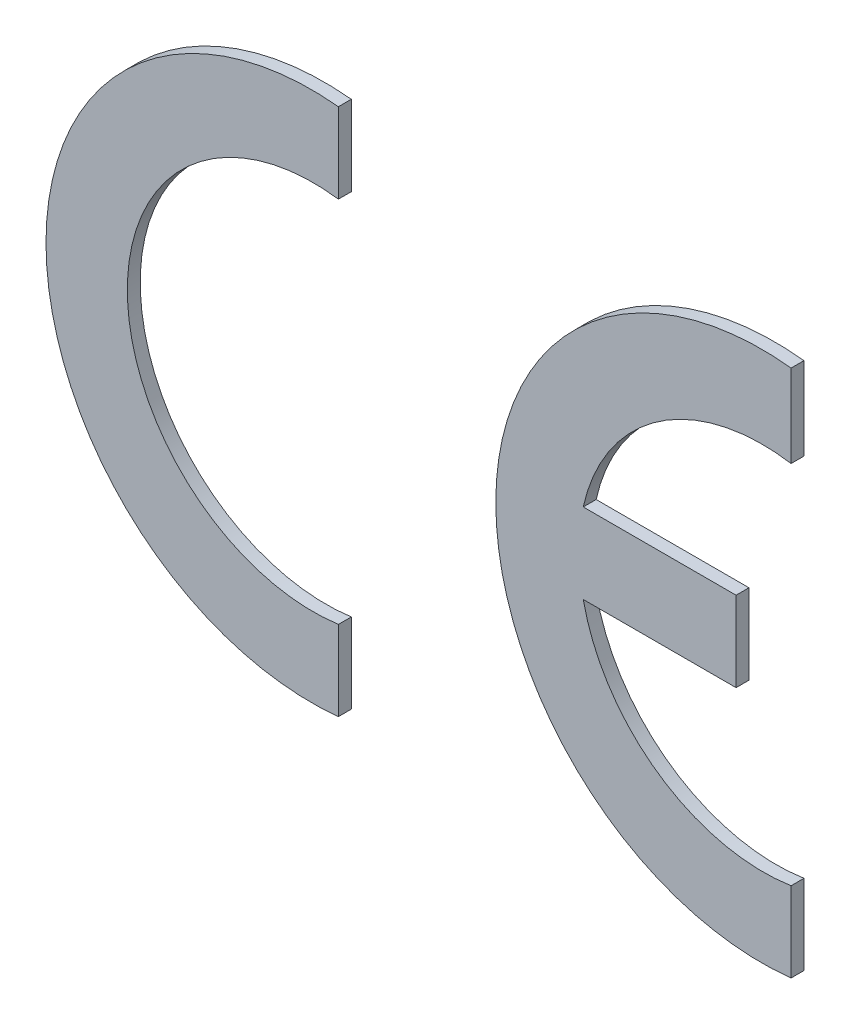
ISO-10303-21;
HEADER;
FILE_DESCRIPTION(('STEP AP214'),'2;1');
FILE_NAME('part.step','',(''),(''),'','','');
FILE_SCHEMA(('AUTOMOTIVE_DESIGN { 1 0 10303 214 1 1 1 1 }'));
ENDSEC;
DATA;
#1=APPLICATION_CONTEXT('core data for automotive mechanical design processes');
#2=APPLICATION_PROTOCOL_DEFINITION('international standard','automotive_design',2000,#1);
#3=PRODUCT_CONTEXT('',#1,'mechanical');
#4=PRODUCT('Part','Part','',(#3));
#5=PRODUCT_RELATED_PRODUCT_CATEGORY('part','',(#4));
#6=PRODUCT_DEFINITION_FORMATION('','',#4);
#7=PRODUCT_DEFINITION_CONTEXT('part definition',#1,'design');
#8=PRODUCT_DEFINITION('design','',#6,#7);
#9=PRODUCT_DEFINITION_SHAPE('','',#8);
#10=(LENGTH_UNIT() NAMED_UNIT(*) SI_UNIT(.MILLI.,.METRE.));
#11=(NAMED_UNIT(*) PLANE_ANGLE_UNIT() SI_UNIT($,.RADIAN.));
#12=(NAMED_UNIT(*) SI_UNIT($,.STERADIAN.) SOLID_ANGLE_UNIT());
#13=UNCERTAINTY_MEASURE_WITH_UNIT(LENGTH_MEASURE(1.E-05),#10,'distance_accuracy_value','');
#14=(GEOMETRIC_REPRESENTATION_CONTEXT(3) GLOBAL_UNCERTAINTY_ASSIGNED_CONTEXT((#13)) GLOBAL_UNIT_ASSIGNED_CONTEXT((#10,
#11,#12)) REPRESENTATION_CONTEXT('',''));
#15=CARTESIAN_POINT('',(0.,0.,0.));
#16=DIRECTION('',(0.,0.,1.));
#17=DIRECTION('',(1.,0.,0.));
#18=AXIS2_PLACEMENT_3D('',#15,#16,#17);
#19=CARTESIAN_POINT('',(1.03806315369261,1.03372418270733,0.));
#20=DIRECTION('',(0.,0.,1.));
#21=DIRECTION('',(1.,0.,0.));
#22=AXIS2_PLACEMENT_3D('',#19,#20,#21);
#23=PLANE('',#22);
#24=DIRECTION('',(0.,1.,0.));
#25=VECTOR('',#24,1.);
#26=CARTESIAN_POINT('',(1.13592234408682,1.03372418270733,0.));
#27=LINE('',#26,#25);
#28=CARTESIAN_POINT('',(1.13592234408682,0.0104547706976291,0.));
#29=VERTEX_POINT('',#28);
#30=CARTESIAN_POINT('',(1.13592234408682,0.320159694376503,0.));
#31=VERTEX_POINT('',#30);
#32=EDGE_CURVE('P0_E63',#29,#31,#27,.T.);
#33=ORIENTED_EDGE('',*,*,#32,.F.);
#34=CARTESIAN_POINT('',(1.03160125210397,1.03405977162411,0.));
#35=DIRECTION('',(0.,0.,-1.));
#36=DIRECTION('',(-1.,0.,0.));
#37=AXIS2_PLACEMENT_3D('',#34,#35,#36);
#38=CIRCLE('',#37,1.02890723010104);
#39=CARTESIAN_POINT('',(1.13592234408682,2.05766477255058,0.));
#40=VERTEX_POINT('',#39);
#41=EDGE_CURVE('P0_E67',#40,#29,#38,.F.);
#42=ORIENTED_EDGE('',*,*,#41,.F.);
#43=DIRECTION('',(0.,1.,0.));
#44=VECTOR('',#43,1.);
#45=CARTESIAN_POINT('',(1.13592234408682,2.05766477255058,0.));
#46=LINE('',#45,#44);
#47=CARTESIAN_POINT('',(1.13592234408682,1.74728867103816,0.));
#48=VERTEX_POINT('',#47);
#49=EDGE_CURVE('P0_E65',#40,#48,#46,.F.);
#50=ORIENTED_EDGE('',*,*,#49,.T.);
#51=CARTESIAN_POINT('',(1.03806315369261,1.03372418270733,0.));
#52=DIRECTION('',(0.,0.,-1.));
#53=DIRECTION('',(-1.,0.,0.));
#54=AXIS2_PLACEMENT_3D('',#51,#52,#53);
#55=CIRCLE('',#54,0.720243500596464);
#56=EDGE_CURVE('P0_E19',#48,#31,#55,.F.);
#57=ORIENTED_EDGE('',*,*,#56,.T.);
#58=EDGE_LOOP('',(#33,#42,#50,#57));
#59=FACE_BOUND('',#58,.T.);
#60=ADVANCED_FACE('P0_F16',(#59),#23,.F.);
#61=CARTESIAN_POINT('',(1.03806315369261,1.03372418270733,0.05));
#62=DIRECTION('',(0.,0.,-1.));
#63=DIRECTION('',(-1.,0.,0.));
#64=AXIS2_PLACEMENT_3D('',#61,#62,#63);
#65=CYLINDRICAL_SURFACE('',#64,0.720243500596464);
#66=DIRECTION('',(0.,0.,1.));
#67=VECTOR('',#66,1.);
#68=CARTESIAN_POINT('',(1.13592234408682,1.74728867103816,0.05));
#69=LINE('',#68,#67);
#70=CARTESIAN_POINT('',(1.13592234408682,1.74728867103816,0.05));
#71=VERTEX_POINT('',#70);
#72=EDGE_CURVE('P0_E57',#48,#71,#69,.T.);
#73=ORIENTED_EDGE('',*,*,#72,.T.);
#74=CARTESIAN_POINT('',(1.03806315369261,1.03372418270733,0.05));
#75=DIRECTION('',(0.,0.,-1.));
#76=DIRECTION('',(-1.,0.,0.));
#77=AXIS2_PLACEMENT_3D('',#74,#75,#76);
#78=CIRCLE('',#77,0.720243500596464);
#79=CARTESIAN_POINT('',(1.13592234408682,0.320159694376503,0.05));
#80=VERTEX_POINT('',#79);
#81=EDGE_CURVE('P0_E80',#80,#71,#78,.T.);
#82=ORIENTED_EDGE('',*,*,#81,.F.);
#83=DIRECTION('',(0.,0.,1.));
#84=VECTOR('',#83,1.);
#85=CARTESIAN_POINT('',(1.13592234408682,0.320159694376503,0.05));
#86=LINE('',#85,#84);
#87=EDGE_CURVE('P0_E60',#80,#31,#86,.F.);
#88=ORIENTED_EDGE('',*,*,#87,.T.);
#89=ORIENTED_EDGE('',*,*,#56,.F.);
#90=EDGE_LOOP('',(#73,#82,#88,#89));
#91=FACE_BOUND('',#90,.T.);
#92=ADVANCED_FACE('P0_F55',(#91),#65,.F.);
#93=CARTESIAN_POINT('',(1.13592234408682,2.05766477255058,0.05));
#94=DIRECTION('',(-1.,0.,0.));
#95=DIRECTION('',(0.,0.,1.));
#96=AXIS2_PLACEMENT_3D('',#93,#94,#95);
#97=PLANE('',#96);
#98=DIRECTION('',(0.,0.,-1.));
#99=VECTOR('',#98,1.);
#100=CARTESIAN_POINT('',(1.13592234408682,2.05766477255058,0.05));
#101=LINE('',#100,#99);
#102=CARTESIAN_POINT('',(1.13592234408682,2.05766477255058,0.05));
#103=VERTEX_POINT('',#102);
#104=EDGE_CURVE('P0_E70',#103,#40,#101,.T.);
#105=ORIENTED_EDGE('',*,*,#104,.F.);
#106=DIRECTION('',(0.,1.,0.));
#107=VECTOR('',#106,1.);
#108=CARTESIAN_POINT('',(1.13592234408682,1.03372418270733,0.05));
#109=LINE('',#108,#107);
#110=EDGE_CURVE('P0_E73',#71,#103,#109,.T.);
#111=ORIENTED_EDGE('',*,*,#110,.F.);
#112=ORIENTED_EDGE('',*,*,#72,.F.);
#113=ORIENTED_EDGE('',*,*,#49,.F.);
#114=EDGE_LOOP('',(#105,#111,#112,#113));
#115=FACE_BOUND('',#114,.T.);
#116=ADVANCED_FACE('P0_F72',(#115),#97,.F.);
#117=CARTESIAN_POINT('',(1.03160125210397,1.03405977162411,0.05));
#118=DIRECTION('',(0.,0.,-1.));
#119=DIRECTION('',(-1.,0.,0.));
#120=AXIS2_PLACEMENT_3D('',#117,#118,#119);
#121=CYLINDRICAL_SURFACE('',#120,1.02890723010104);
#122=ORIENTED_EDGE('',*,*,#41,.T.);
#123=DIRECTION('',(0.,0.,1.));
#124=VECTOR('',#123,1.);
#125=CARTESIAN_POINT('',(1.13592234408682,0.010454770697629,0.05));
#126=LINE('',#125,#124);
#127=CARTESIAN_POINT('',(1.13592234408682,0.0104547706976291,0.05));
#128=VERTEX_POINT('',#127);
#129=EDGE_CURVE('P0_E81',#29,#128,#126,.T.);
#130=ORIENTED_EDGE('',*,*,#129,.T.);
#131=CARTESIAN_POINT('',(1.03160125210397,1.03405977162411,0.05));
#132=DIRECTION('',(0.,0.,-1.));
#133=DIRECTION('',(-1.,0.,0.));
#134=AXIS2_PLACEMENT_3D('',#131,#132,#133);
#135=CIRCLE('',#134,1.02890723010104);
#136=EDGE_CURVE('P0_E25',#103,#128,#135,.F.);
#137=ORIENTED_EDGE('',*,*,#136,.F.);
#138=ORIENTED_EDGE('',*,*,#104,.T.);
#139=EDGE_LOOP('',(#122,#130,#137,#138));
#140=FACE_BOUND('',#139,.T.);
#141=ADVANCED_FACE('P0_F85',(#140),#121,.T.);
#142=CARTESIAN_POINT('',(1.13592234408682,0.320159694376503,0.05));
#143=DIRECTION('',(-1.,0.,0.));
#144=DIRECTION('',(0.,0.,1.));
#145=AXIS2_PLACEMENT_3D('',#142,#143,#144);
#146=PLANE('',#145);
#147=ORIENTED_EDGE('',*,*,#87,.F.);
#148=DIRECTION('',(0.,1.,0.));
#149=VECTOR('',#148,1.);
#150=CARTESIAN_POINT('',(1.13592234408682,1.03372418270733,0.05));
#151=LINE('',#150,#149);
#152=EDGE_CURVE('P0_E11',#128,#80,#151,.T.);
#153=ORIENTED_EDGE('',*,*,#152,.F.);
#154=ORIENTED_EDGE('',*,*,#129,.F.);
#155=ORIENTED_EDGE('',*,*,#32,.T.);
#156=EDGE_LOOP('',(#147,#153,#154,#155));
#157=FACE_BOUND('',#156,.T.);
#158=ADVANCED_FACE('P0_F90',(#157),#146,.F.);
#159=CARTESIAN_POINT('',(1.03806315369261,1.03372418270733,0.05));
#160=DIRECTION('',(0.,0.,1.));
#161=DIRECTION('',(1.,0.,0.));
#162=AXIS2_PLACEMENT_3D('',#159,#160,#161);
#163=PLANE('',#162);
#164=ORIENTED_EDGE('',*,*,#136,.T.);
#165=ORIENTED_EDGE('',*,*,#152,.T.);
#166=ORIENTED_EDGE('',*,*,#81,.T.);
#167=ORIENTED_EDGE('',*,*,#110,.T.);
#168=EDGE_LOOP('',(#164,#165,#166,#167));
#169=FACE_BOUND('',#168,.T.);
#170=ADVANCED_FACE('P0_F87',(#169),#163,.T.);
#171=CLOSED_SHELL('',(#60,#92,#116,#141,#158,#170));
#172=MANIFOLD_SOLID_BREP('P0_B1',#171);
#173=CARTESIAN_POINT('',(2.77845442561025,1.0358585704621,0.));
#174=DIRECTION('',(0.,0.,1.));
#175=DIRECTION('',(1.,0.,0.));
#176=AXIS2_PLACEMENT_3D('',#173,#174,#175);
#177=PLANE('',#176);
#178=DIRECTION('',(1.,0.,0.));
#179=VECTOR('',#178,1.);
#180=CARTESIAN_POINT('',(2.77845442561025,1.18870747193124,0.));
#181=LINE('',#180,#179);
#182=CARTESIAN_POINT('',(2.67719202891527,1.18870747193124,0.));
#183=VERTEX_POINT('',#182);
#184=CARTESIAN_POINT('',(2.08489882740753,1.18870747193124,0.));
#185=VERTEX_POINT('',#184);
#186=EDGE_CURVE('P1_E87',#183,#185,#181,.F.);
#187=ORIENTED_EDGE('',*,*,#186,.F.);
#188=DIRECTION('',(0.,1.,0.));
#189=VECTOR('',#188,1.);
#190=CARTESIAN_POINT('',(2.67719202891527,1.0358585704621,0.));
#191=LINE('',#190,#189);
#192=CARTESIAN_POINT('',(2.67719202891527,0.878264813773018,0.));
#193=VERTEX_POINT('',#192);
#194=EDGE_CURVE('P1_E106',#193,#183,#191,.T.);
#195=ORIENTED_EDGE('',*,*,#194,.F.);
#196=DIRECTION('',(1.,0.,0.));
#197=VECTOR('',#196,1.);
#198=CARTESIAN_POINT('',(2.77845442561025,0.878264813773018,0.));
#199=LINE('',#198,#197);
#200=CARTESIAN_POINT('',(2.08489882740753,0.878264813773018,0.));
#201=VERTEX_POINT('',#200);
#202=EDGE_CURVE('P1_E109',#201,#193,#199,.T.);
#203=ORIENTED_EDGE('',*,*,#202,.F.);
#204=CARTESIAN_POINT('',(2.78248465232511,1.02473124299253,0.));
#205=DIRECTION('',(0.,0.,-1.));
#206=DIRECTION('',(-1.,0.,0.));
#207=AXIS2_PLACEMENT_3D('',#204,#205,#206);
#208=CIRCLE('',#207,0.71279618265971);
#209=CARTESIAN_POINT('',(2.89045377242468,0.320159694376504,0.));
#210=VERTEX_POINT('',#209);
#211=EDGE_CURVE('P1_E129',#201,#210,#208,.F.);
#212=ORIENTED_EDGE('',*,*,#211,.T.);
#213=DIRECTION('',(0.,1.,0.));
#214=VECTOR('',#213,1.);
#215=CARTESIAN_POINT('',(2.89045377242468,0.320159694376503,0.));
#216=LINE('',#215,#214);
#217=CARTESIAN_POINT('',(2.89045377242468,0.0104547706976293,0.));
#218=VERTEX_POINT('',#217);
#219=EDGE_CURVE('P1_E113',#210,#218,#216,.F.);
#220=ORIENTED_EDGE('',*,*,#219,.T.);
#221=CARTESIAN_POINT('',(2.77595196982339,1.03405977162411,0.));
#222=DIRECTION('',(0.,0.,-1.));
#223=DIRECTION('',(-1.,0.,0.));
#224=AXIS2_PLACEMENT_3D('',#221,#222,#223);
#225=CIRCLE('',#224,1.02998925272094);
#226=CARTESIAN_POINT('',(2.89045377242468,2.05766477255058,0.));
#227=VERTEX_POINT('',#226);
#228=EDGE_CURVE('P1_E91',#227,#218,#225,.F.);
#229=ORIENTED_EDGE('',*,*,#228,.F.);
#230=DIRECTION('',(0.,1.,0.));
#231=VECTOR('',#230,1.);
#232=CARTESIAN_POINT('',(2.89045377242468,2.05766477255058,0.));
#233=LINE('',#232,#231);
#234=CARTESIAN_POINT('',(2.89045377242468,1.73717041321951,0.));
#235=VERTEX_POINT('',#234);
#236=EDGE_CURVE('P1_E89',#227,#235,#233,.F.);
#237=ORIENTED_EDGE('',*,*,#236,.T.);
#238=CARTESIAN_POINT('',(2.77845442561025,1.0358585704621,0.));
#239=DIRECTION('',(0.,0.,-1.));
#240=DIRECTION('',(-1.,0.,0.));
#241=AXIS2_PLACEMENT_3D('',#238,#239,#240);
#242=CIRCLE('',#241,0.710198672540755);
#243=EDGE_CURVE('P1_E19',#235,#185,#242,.F.);
#244=ORIENTED_EDGE('',*,*,#243,.T.);
#245=EDGE_LOOP('',(#187,#195,#203,#212,#220,#229,#237,#244));
#246=FACE_BOUND('',#245,.T.);
#247=ADVANCED_FACE('P1_F16',(#246),#177,.F.);
#248=CARTESIAN_POINT('',(2.77845442561025,1.0358585704621,0.05));
#249=DIRECTION('',(0.,0.,-1.));
#250=DIRECTION('',(-1.,0.,0.));
#251=AXIS2_PLACEMENT_3D('',#248,#249,#250);
#252=CYLINDRICAL_SURFACE('',#251,0.710198672540755);
#253=DIRECTION('',(0.,0.,1.));
#254=VECTOR('',#253,1.);
#255=CARTESIAN_POINT('',(2.89045377242468,1.73717041321951,0.05));
#256=LINE('',#255,#254);
#257=CARTESIAN_POINT('',(2.89045377242468,1.73717041321951,0.05));
#258=VERTEX_POINT('',#257);
#259=EDGE_CURVE('P1_E81',#235,#258,#256,.T.);
#260=ORIENTED_EDGE('',*,*,#259,.T.);
#261=CARTESIAN_POINT('',(2.77845442561025,1.0358585704621,0.05));
#262=DIRECTION('',(0.,0.,-1.));
#263=DIRECTION('',(-1.,0.,0.));
#264=AXIS2_PLACEMENT_3D('',#261,#262,#263);
#265=CIRCLE('',#264,0.710198672540755);
#266=CARTESIAN_POINT('',(2.08489882740753,1.18870747193124,0.05));
#267=VERTEX_POINT('',#266);
#268=EDGE_CURVE('P1_E127',#267,#258,#265,.T.);
#269=ORIENTED_EDGE('',*,*,#268,.F.);
#270=DIRECTION('',(0.,0.,-1.));
#271=VECTOR('',#270,1.);
#272=CARTESIAN_POINT('',(2.08489882740753,1.18870747193124,0.05));
#273=LINE('',#272,#271);
#274=EDGE_CURVE('P1_E84',#267,#185,#273,.T.);
#275=ORIENTED_EDGE('',*,*,#274,.T.);
#276=ORIENTED_EDGE('',*,*,#243,.F.);
#277=EDGE_LOOP('',(#260,#269,#275,#276));
#278=FACE_BOUND('',#277,.T.);
#279=ADVANCED_FACE('P1_F79',(#278),#252,.F.);
#280=CARTESIAN_POINT('',(2.89045377242468,2.05766477255058,0.05));
#281=DIRECTION('',(-1.,0.,0.));
#282=DIRECTION('',(0.,0.,1.));
#283=AXIS2_PLACEMENT_3D('',#280,#281,#282);
#284=PLANE('',#283);
#285=DIRECTION('',(0.,0.,-1.));
#286=VECTOR('',#285,1.);
#287=CARTESIAN_POINT('',(2.89045377242468,2.05766477255058,0.05));
#288=LINE('',#287,#286);
#289=CARTESIAN_POINT('',(2.89045377242468,2.05766477255058,0.05));
#290=VERTEX_POINT('',#289);
#291=EDGE_CURVE('P1_E94',#290,#227,#288,.T.);
#292=ORIENTED_EDGE('',*,*,#291,.F.);
#293=DIRECTION('',(0.,1.,0.));
#294=VECTOR('',#293,1.);
#295=CARTESIAN_POINT('',(2.89045377242468,1.0358585704621,0.05));
#296=LINE('',#295,#294);
#297=EDGE_CURVE('P1_E98',#258,#290,#296,.T.);
#298=ORIENTED_EDGE('',*,*,#297,.F.);
#299=ORIENTED_EDGE('',*,*,#259,.F.);
#300=ORIENTED_EDGE('',*,*,#236,.F.);
#301=EDGE_LOOP('',(#292,#298,#299,#300));
#302=FACE_BOUND('',#301,.T.);
#303=ADVANCED_FACE('P1_F96',(#302),#284,.F.);
#304=CARTESIAN_POINT('',(2.77595196982339,1.03405977162411,0.05));
#305=DIRECTION('',(0.,0.,-1.));
#306=DIRECTION('',(-1.,0.,0.));
#307=AXIS2_PLACEMENT_3D('',#304,#305,#306);
#308=CYLINDRICAL_SURFACE('',#307,1.02998925272094);
#309=ORIENTED_EDGE('',*,*,#228,.T.);
#310=DIRECTION('',(0.,0.,1.));
#311=VECTOR('',#310,1.);
#312=CARTESIAN_POINT('',(2.89045377242468,0.0104547706976294,0.05));
#313=LINE('',#312,#311);
#314=CARTESIAN_POINT('',(2.89045377242468,0.0104547706976294,0.05));
#315=VERTEX_POINT('',#314);
#316=EDGE_CURVE('P1_E115',#218,#315,#313,.T.);
#317=ORIENTED_EDGE('',*,*,#316,.T.);
#318=CARTESIAN_POINT('',(2.77595196982339,1.03405977162411,0.05));
#319=DIRECTION('',(0.,0.,-1.));
#320=DIRECTION('',(-1.,0.,0.));
#321=AXIS2_PLACEMENT_3D('',#318,#319,#320);
#322=CIRCLE('',#321,1.02998925272094);
#323=EDGE_CURVE('P1_E125',#290,#315,#322,.F.);
#324=ORIENTED_EDGE('',*,*,#323,.F.);
#325=ORIENTED_EDGE('',*,*,#291,.T.);
#326=EDGE_LOOP('',(#309,#317,#324,#325));
#327=FACE_BOUND('',#326,.T.);
#328=ADVANCED_FACE('P1_F135',(#327),#308,.T.);
#329=CARTESIAN_POINT('',(2.89045377242468,0.320159694376503,0.05));
#330=DIRECTION('',(-1.,0.,0.));
#331=DIRECTION('',(0.,0.,1.));
#332=AXIS2_PLACEMENT_3D('',#329,#330,#331);
#333=PLANE('',#332);
#334=DIRECTION('',(0.,0.,-1.));
#335=VECTOR('',#334,1.);
#336=CARTESIAN_POINT('',(2.89045377242468,0.320159694376504,0.05));
#337=LINE('',#336,#335);
#338=CARTESIAN_POINT('',(2.89045377242468,0.320159694376504,0.05));
#339=VERTEX_POINT('',#338);
#340=EDGE_CURVE('P1_E114',#210,#339,#337,.F.);
#341=ORIENTED_EDGE('',*,*,#340,.T.);
#342=DIRECTION('',(0.,1.,0.));
#343=VECTOR('',#342,1.);
#344=CARTESIAN_POINT('',(2.89045377242468,1.0358585704621,0.05));
#345=LINE('',#344,#343);
#346=EDGE_CURVE('P1_E124',#315,#339,#345,.T.);
#347=ORIENTED_EDGE('',*,*,#346,.F.);
#348=ORIENTED_EDGE('',*,*,#316,.F.);
#349=ORIENTED_EDGE('',*,*,#219,.F.);
#350=EDGE_LOOP('',(#341,#347,#348,#349));
#351=FACE_BOUND('',#350,.T.);
#352=ADVANCED_FACE('P1_F161',(#351),#333,.F.);
#353=CARTESIAN_POINT('',(2.78248465232511,1.02473124299253,0.05));
#354=DIRECTION('',(0.,0.,-1.));
#355=DIRECTION('',(-1.,0.,0.));
#356=AXIS2_PLACEMENT_3D('',#353,#354,#355);
#357=CYLINDRICAL_SURFACE('',#356,0.71279618265971);
#358=DIRECTION('',(0.,0.,1.));
#359=VECTOR('',#358,1.);
#360=CARTESIAN_POINT('',(2.08489882740753,0.878264813773018,0.05));
#361=LINE('',#360,#359);
#362=CARTESIAN_POINT('',(2.08489882740753,0.878264813773018,0.05));
#363=VERTEX_POINT('',#362);
#364=EDGE_CURVE('P1_E131',#201,#363,#361,.T.);
#365=ORIENTED_EDGE('',*,*,#364,.T.);
#366=CARTESIAN_POINT('',(2.78248465232511,1.02473124299253,0.05));
#367=DIRECTION('',(0.,0.,-1.));
#368=DIRECTION('',(-1.,0.,0.));
#369=AXIS2_PLACEMENT_3D('',#366,#367,#368);
#370=CIRCLE('',#369,0.71279618265971);
#371=EDGE_CURVE('P1_E120',#339,#363,#370,.T.);
#372=ORIENTED_EDGE('',*,*,#371,.F.);
#373=ORIENTED_EDGE('',*,*,#340,.F.);
#374=ORIENTED_EDGE('',*,*,#211,.F.);
#375=EDGE_LOOP('',(#365,#372,#373,#374));
#376=FACE_BOUND('',#375,.T.);
#377=ADVANCED_FACE('P1_F164',(#376),#357,.F.);
#378=CARTESIAN_POINT('',(2.08489882740753,0.878264813773018,0.05));
#379=DIRECTION('',(0.,1.,0.));
#380=DIRECTION('',(0.,0.,1.));
#381=AXIS2_PLACEMENT_3D('',#378,#379,#380);
#382=PLANE('',#381);
#383=DIRECTION('',(0.,0.,1.));
#384=VECTOR('',#383,1.);
#385=CARTESIAN_POINT('',(2.67719202891527,0.878264813773018,0.05));
#386=LINE('',#385,#384);
#387=CARTESIAN_POINT('',(2.67719202891527,0.878264813773018,0.05));
#388=VERTEX_POINT('',#387);
#389=EDGE_CURVE('P1_E148',#193,#388,#386,.T.);
#390=ORIENTED_EDGE('',*,*,#389,.T.);
#391=DIRECTION('',(1.,0.,0.));
#392=VECTOR('',#391,1.);
#393=CARTESIAN_POINT('',(2.77845442561025,0.878264813773018,0.05));
#394=LINE('',#393,#392);
#395=EDGE_CURVE('P1_E123',#363,#388,#394,.T.);
#396=ORIENTED_EDGE('',*,*,#395,.F.);
#397=ORIENTED_EDGE('',*,*,#364,.F.);
#398=ORIENTED_EDGE('',*,*,#202,.T.);
#399=EDGE_LOOP('',(#390,#396,#397,#398));
#400=FACE_BOUND('',#399,.T.);
#401=ADVANCED_FACE('P1_F173',(#400),#382,.F.);
#402=CARTESIAN_POINT('',(2.67719202891527,0.878264813773018,0.05));
#403=DIRECTION('',(-1.,0.,0.));
#404=DIRECTION('',(0.,0.,1.));
#405=AXIS2_PLACEMENT_3D('',#402,#403,#404);
#406=PLANE('',#405);
#407=DIRECTION('',(0.,0.,-1.));
#408=VECTOR('',#407,1.);
#409=CARTESIAN_POINT('',(2.67719202891527,1.18870747193124,0.05));
#410=LINE('',#409,#408);
#411=CARTESIAN_POINT('',(2.67719202891527,1.18870747193124,0.05));
#412=VERTEX_POINT('',#411);
#413=EDGE_CURVE('P1_E34',#183,#412,#410,.F.);
#414=ORIENTED_EDGE('',*,*,#413,.T.);
#415=DIRECTION('',(0.,1.,0.));
#416=VECTOR('',#415,1.);
#417=CARTESIAN_POINT('',(2.67719202891527,1.0358585704621,0.05));
#418=LINE('',#417,#416);
#419=EDGE_CURVE('P1_E25',#388,#412,#418,.T.);
#420=ORIENTED_EDGE('',*,*,#419,.F.);
#421=ORIENTED_EDGE('',*,*,#389,.F.);
#422=ORIENTED_EDGE('',*,*,#194,.T.);
#423=EDGE_LOOP('',(#414,#420,#421,#422));
#424=FACE_BOUND('',#423,.T.);
#425=ADVANCED_FACE('P1_F176',(#424),#406,.F.);
#426=CARTESIAN_POINT('',(2.67719202891527,1.18870747193124,0.05));
#427=DIRECTION('',(0.,-1.,0.));
#428=DIRECTION('',(0.,0.,-1.));
#429=AXIS2_PLACEMENT_3D('',#426,#427,#428);
#430=PLANE('',#429);
#431=ORIENTED_EDGE('',*,*,#274,.F.);
#432=DIRECTION('',(1.,0.,0.));
#433=VECTOR('',#432,1.);
#434=CARTESIAN_POINT('',(2.77845442561025,1.18870747193124,0.05));
#435=LINE('',#434,#433);
#436=EDGE_CURVE('P1_E11',#412,#267,#435,.F.);
#437=ORIENTED_EDGE('',*,*,#436,.F.);
#438=ORIENTED_EDGE('',*,*,#413,.F.);
#439=ORIENTED_EDGE('',*,*,#186,.T.);
#440=EDGE_LOOP('',(#431,#437,#438,#439));
#441=FACE_BOUND('',#440,.T.);
#442=ADVANCED_FACE('P1_F178',(#441),#430,.F.);
#443=CARTESIAN_POINT('',(2.77845442561025,1.0358585704621,0.05));
#444=DIRECTION('',(0.,0.,1.));
#445=DIRECTION('',(1.,0.,0.));
#446=AXIS2_PLACEMENT_3D('',#443,#444,#445);
#447=PLANE('',#446);
#448=ORIENTED_EDGE('',*,*,#419,.T.);
#449=ORIENTED_EDGE('',*,*,#436,.T.);
#450=ORIENTED_EDGE('',*,*,#268,.T.);
#451=ORIENTED_EDGE('',*,*,#297,.T.);
#452=ORIENTED_EDGE('',*,*,#323,.T.);
#453=ORIENTED_EDGE('',*,*,#346,.T.);
#454=ORIENTED_EDGE('',*,*,#371,.T.);
#455=ORIENTED_EDGE('',*,*,#395,.T.);
#456=EDGE_LOOP('',(#448,#449,#450,#451,#452,#453,#454,#455));
#457=FACE_BOUND('',#456,.T.);
#458=ADVANCED_FACE('P1_F141',(#457),#447,.T.);
#459=CLOSED_SHELL('',(#247,#279,#303,#328,#352,#377,#401,#425,#442,#458));
#460=MANIFOLD_SOLID_BREP('P1_B1',#459);
#461=ADVANCED_BREP_SHAPE_REPRESENTATION('',(#18,#172,#460),#14);
#462=SHAPE_DEFINITION_REPRESENTATION(#9,#461);
ENDSEC;
END-ISO-10303-21;
